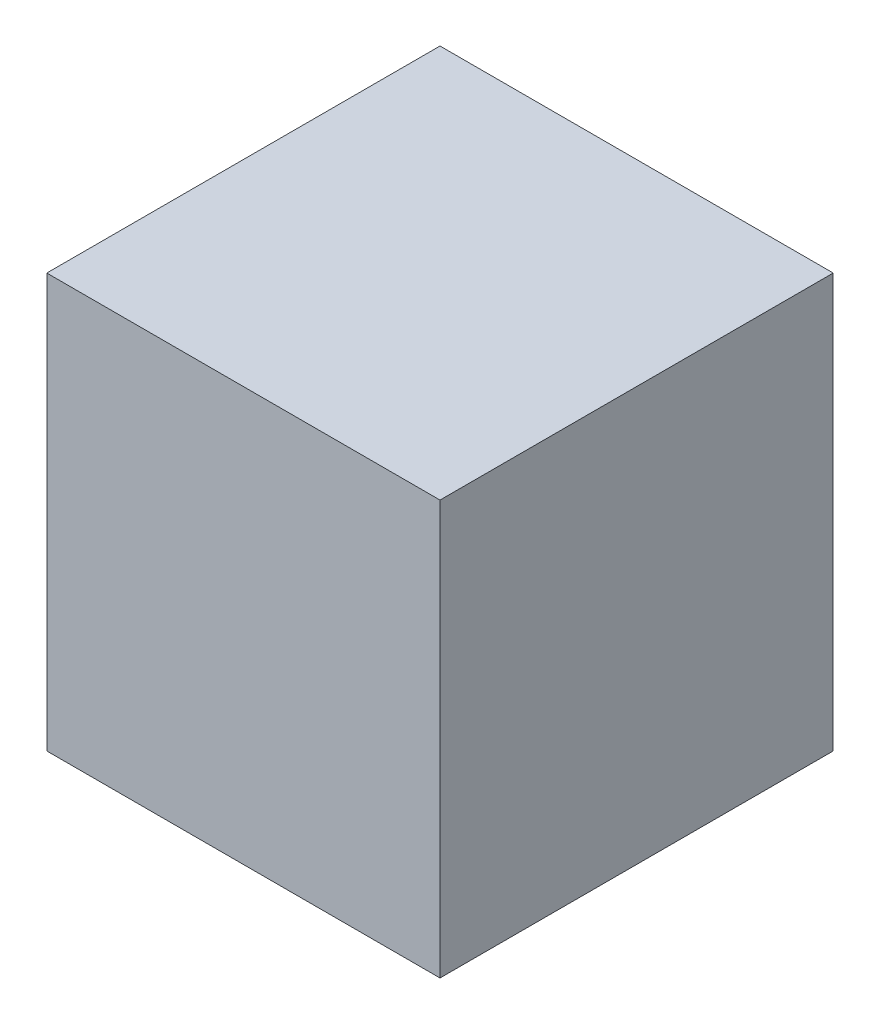
ISO-10303-21;
HEADER;
FILE_DESCRIPTION(('STEP AP214'),'2;1');
FILE_NAME('part.step','',(''),(''),'','','');
FILE_SCHEMA(('AUTOMOTIVE_DESIGN { 1 0 10303 214 1 1 1 1 }'));
ENDSEC;
DATA;
#1=APPLICATION_CONTEXT('core data for automotive mechanical design processes');
#2=APPLICATION_PROTOCOL_DEFINITION('international standard','automotive_design',2000,#1);
#3=PRODUCT_CONTEXT('',#1,'mechanical');
#4=PRODUCT('Part','Part','',(#3));
#5=PRODUCT_RELATED_PRODUCT_CATEGORY('part','',(#4));
#6=PRODUCT_DEFINITION_FORMATION('','',#4);
#7=PRODUCT_DEFINITION_CONTEXT('part definition',#1,'design');
#8=PRODUCT_DEFINITION('design','',#6,#7);
#9=PRODUCT_DEFINITION_SHAPE('','',#8);
#10=(LENGTH_UNIT() NAMED_UNIT(*) SI_UNIT(.MILLI.,.METRE.));
#11=(NAMED_UNIT(*) PLANE_ANGLE_UNIT() SI_UNIT($,.RADIAN.));
#12=(NAMED_UNIT(*) SI_UNIT($,.STERADIAN.) SOLID_ANGLE_UNIT());
#13=UNCERTAINTY_MEASURE_WITH_UNIT(LENGTH_MEASURE(1.E-05),#10,'distance_accuracy_value','');
#14=(GEOMETRIC_REPRESENTATION_CONTEXT(3) GLOBAL_UNCERTAINTY_ASSIGNED_CONTEXT((#13)) GLOBAL_UNIT_ASSIGNED_CONTEXT((#10,
#11,#12)) REPRESENTATION_CONTEXT('',''));
#15=CARTESIAN_POINT('',(0.,0.,0.));
#16=DIRECTION('',(0.,0.,1.));
#17=DIRECTION('',(1.,0.,0.));
#18=AXIS2_PLACEMENT_3D('',#15,#16,#17);
#19=CARTESIAN_POINT('',(-241.3,508.,241.3));
#20=DIRECTION('',(1.,0.,0.));
#21=DIRECTION('',(0.,0.,-1.));
#22=AXIS2_PLACEMENT_3D('',#19,#20,#21);
#23=PLANE('',#22);
#24=DIRECTION('',(0.,0.,1.));
#25=VECTOR('',#24,1.);
#26=CARTESIAN_POINT('',(-241.3,0.,241.3));
#27=LINE('',#26,#25);
#28=CARTESIAN_POINT('',(-241.3,0.,-241.3));
#29=VERTEX_POINT('',#28);
#30=CARTESIAN_POINT('',(-241.3,0.,241.3));
#31=VERTEX_POINT('',#30);
#32=EDGE_CURVE('E98',#29,#31,#27,.T.);
#33=ORIENTED_EDGE('',*,*,#32,.T.);
#34=DIRECTION('',(0.,-1.,0.));
#35=VECTOR('',#34,1.);
#36=CARTESIAN_POINT('',(-241.3,508.,241.3));
#37=LINE('',#36,#35);
#38=CARTESIAN_POINT('',(-241.3,508.,241.3));
#39=VERTEX_POINT('',#38);
#40=EDGE_CURVE('E11',#39,#31,#37,.T.);
#41=ORIENTED_EDGE('',*,*,#40,.F.);
#42=DIRECTION('',(0.,0.,1.));
#43=VECTOR('',#42,1.);
#44=CARTESIAN_POINT('',(-241.3,508.,241.3));
#45=LINE('',#44,#43);
#46=CARTESIAN_POINT('',(-241.3,508.,-241.3));
#47=VERTEX_POINT('',#46);
#48=EDGE_CURVE('E86',#47,#39,#45,.T.);
#49=ORIENTED_EDGE('',*,*,#48,.F.);
#50=DIRECTION('',(0.,-1.,0.));
#51=VECTOR('',#50,1.);
#52=CARTESIAN_POINT('',(-241.3,508.,-241.3));
#53=LINE('',#52,#51);
#54=EDGE_CURVE('E94',#47,#29,#53,.T.);
#55=ORIENTED_EDGE('',*,*,#54,.T.);
#56=EDGE_LOOP('',(#33,#41,#49,#55));
#57=FACE_BOUND('',#56,.T.);
#58=ADVANCED_FACE('F35',(#57),#23,.F.);
#59=CARTESIAN_POINT('',(241.3,508.,241.3));
#60=DIRECTION('',(0.,0.,-1.));
#61=DIRECTION('',(-1.,0.,0.));
#62=AXIS2_PLACEMENT_3D('',#59,#60,#61);
#63=PLANE('',#62);
#64=DIRECTION('',(1.,0.,0.));
#65=VECTOR('',#64,1.);
#66=CARTESIAN_POINT('',(241.3,0.,241.3));
#67=LINE('',#66,#65);
#68=CARTESIAN_POINT('',(241.3,0.,241.3));
#69=VERTEX_POINT('',#68);
#70=EDGE_CURVE('E90',#31,#69,#67,.T.);
#71=ORIENTED_EDGE('',*,*,#70,.T.);
#72=DIRECTION('',(0.,-1.,0.));
#73=VECTOR('',#72,1.);
#74=CARTESIAN_POINT('',(241.3,508.,241.3));
#75=LINE('',#74,#73);
#76=CARTESIAN_POINT('',(241.3,508.,241.3));
#77=VERTEX_POINT('',#76);
#78=EDGE_CURVE('E43',#77,#69,#75,.T.);
#79=ORIENTED_EDGE('',*,*,#78,.F.);
#80=DIRECTION('',(1.,0.,0.));
#81=VECTOR('',#80,1.);
#82=CARTESIAN_POINT('',(241.3,508.,241.3));
#83=LINE('',#82,#81);
#84=EDGE_CURVE('E81',#39,#77,#83,.T.);
#85=ORIENTED_EDGE('',*,*,#84,.F.);
#86=ORIENTED_EDGE('',*,*,#40,.T.);
#87=EDGE_LOOP('',(#71,#79,#85,#86));
#88=FACE_BOUND('',#87,.T.);
#89=ADVANCED_FACE('F89',(#88),#63,.F.);
#90=CARTESIAN_POINT('',(241.3,508.,241.3));
#91=DIRECTION('',(-1.,0.,0.));
#92=DIRECTION('',(0.,0.,1.));
#93=AXIS2_PLACEMENT_3D('',#90,#91,#92);
#94=PLANE('',#93);
#95=DIRECTION('',(0.,0.,-1.));
#96=VECTOR('',#95,1.);
#97=CARTESIAN_POINT('',(241.3,0.,241.3));
#98=LINE('',#97,#96);
#99=CARTESIAN_POINT('',(241.3,0.,-241.3));
#100=VERTEX_POINT('',#99);
#101=EDGE_CURVE('E68',#69,#100,#98,.T.);
#102=ORIENTED_EDGE('',*,*,#101,.T.);
#103=DIRECTION('',(0.,-1.,0.));
#104=VECTOR('',#103,1.);
#105=CARTESIAN_POINT('',(241.3,508.,-241.3));
#106=LINE('',#105,#104);
#107=CARTESIAN_POINT('',(241.3,508.,-241.3));
#108=VERTEX_POINT('',#107);
#109=EDGE_CURVE('E91',#108,#100,#106,.T.);
#110=ORIENTED_EDGE('',*,*,#109,.F.);
#111=DIRECTION('',(0.,0.,-1.));
#112=VECTOR('',#111,1.);
#113=CARTESIAN_POINT('',(241.3,508.,241.3));
#114=LINE('',#113,#112);
#115=EDGE_CURVE('E84',#77,#108,#114,.T.);
#116=ORIENTED_EDGE('',*,*,#115,.F.);
#117=ORIENTED_EDGE('',*,*,#78,.T.);
#118=EDGE_LOOP('',(#102,#110,#116,#117));
#119=FACE_BOUND('',#118,.T.);
#120=ADVANCED_FACE('F92',(#119),#94,.F.);
#121=CARTESIAN_POINT('',(241.3,508.,-241.3));
#122=DIRECTION('',(0.,0.,1.));
#123=DIRECTION('',(1.,0.,0.));
#124=AXIS2_PLACEMENT_3D('',#121,#122,#123);
#125=PLANE('',#124);
#126=DIRECTION('',(-1.,0.,0.));
#127=VECTOR('',#126,1.);
#128=CARTESIAN_POINT('',(241.3,0.,-241.3));
#129=LINE('',#128,#127);
#130=EDGE_CURVE('E74',#100,#29,#129,.T.);
#131=ORIENTED_EDGE('',*,*,#130,.T.);
#132=ORIENTED_EDGE('',*,*,#54,.F.);
#133=DIRECTION('',(-1.,0.,0.));
#134=VECTOR('',#133,1.);
#135=CARTESIAN_POINT('',(241.3,508.,-241.3));
#136=LINE('',#135,#134);
#137=EDGE_CURVE('E51',#108,#47,#136,.T.);
#138=ORIENTED_EDGE('',*,*,#137,.F.);
#139=ORIENTED_EDGE('',*,*,#109,.T.);
#140=EDGE_LOOP('',(#131,#132,#138,#139));
#141=FACE_BOUND('',#140,.T.);
#142=ADVANCED_FACE('F105',(#141),#125,.F.);
#143=CARTESIAN_POINT('',(0.,508.,0.));
#144=DIRECTION('',(0.,1.,0.));
#145=DIRECTION('',(0.,0.,1.));
#146=AXIS2_PLACEMENT_3D('',#143,#144,#145);
#147=PLANE('',#146);
#148=ORIENTED_EDGE('',*,*,#48,.T.);
#149=ORIENTED_EDGE('',*,*,#84,.T.);
#150=ORIENTED_EDGE('',*,*,#115,.T.);
#151=ORIENTED_EDGE('',*,*,#137,.T.);
#152=EDGE_LOOP('',(#148,#149,#150,#151));
#153=FACE_BOUND('',#152,.T.);
#154=ADVANCED_FACE('F82',(#153),#147,.T.);
#155=CARTESIAN_POINT('',(0.,0.,0.));
#156=DIRECTION('',(0.,1.,0.));
#157=DIRECTION('',(0.,0.,1.));
#158=AXIS2_PLACEMENT_3D('',#155,#156,#157);
#159=PLANE('',#158);
#160=ORIENTED_EDGE('',*,*,#32,.F.);
#161=ORIENTED_EDGE('',*,*,#130,.F.);
#162=ORIENTED_EDGE('',*,*,#101,.F.);
#163=ORIENTED_EDGE('',*,*,#70,.F.);
#164=EDGE_LOOP('',(#160,#161,#162,#163));
#165=FACE_BOUND('',#164,.T.);
#166=ADVANCED_FACE('F108',(#165),#159,.F.);
#167=CLOSED_SHELL('',(#58,#89,#120,#142,#154,#166));
#168=MANIFOLD_SOLID_BREP('B2',#167);
#169=ADVANCED_BREP_SHAPE_REPRESENTATION('',(#18,#168),#14);
#170=SHAPE_DEFINITION_REPRESENTATION(#9,#169);
ENDSEC;
END-ISO-10303-21;
